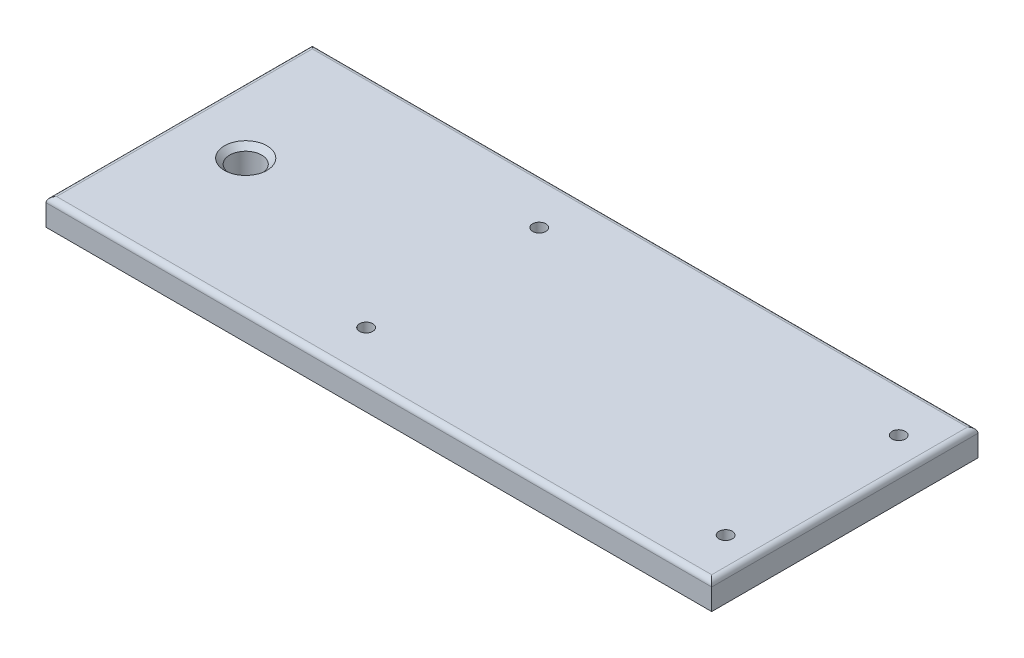
ISO-10303-21;
HEADER;
FILE_DESCRIPTION(('STEP AP214'),'2;1');
FILE_NAME('part.step','',(''),(''),'','','');
FILE_SCHEMA(('AUTOMOTIVE_DESIGN { 1 0 10303 214 1 1 1 1 }'));
ENDSEC;
DATA;
#1=APPLICATION_CONTEXT('core data for automotive mechanical design processes');
#2=APPLICATION_PROTOCOL_DEFINITION('international standard','automotive_design',2000,#1);
#3=PRODUCT_CONTEXT('',#1,'mechanical');
#4=PRODUCT('Part','Part','',(#3));
#5=PRODUCT_RELATED_PRODUCT_CATEGORY('part','',(#4));
#6=PRODUCT_DEFINITION_FORMATION('','',#4);
#7=PRODUCT_DEFINITION_CONTEXT('part definition',#1,'design');
#8=PRODUCT_DEFINITION('design','',#6,#7);
#9=PRODUCT_DEFINITION_SHAPE('','',#8);
#10=(LENGTH_UNIT() NAMED_UNIT(*) SI_UNIT(.MILLI.,.METRE.));
#11=(NAMED_UNIT(*) PLANE_ANGLE_UNIT() SI_UNIT($,.RADIAN.));
#12=(NAMED_UNIT(*) SI_UNIT($,.STERADIAN.) SOLID_ANGLE_UNIT());
#13=UNCERTAINTY_MEASURE_WITH_UNIT(LENGTH_MEASURE(1.E-05),#10,'distance_accuracy_value','');
#14=(GEOMETRIC_REPRESENTATION_CONTEXT(3) GLOBAL_UNCERTAINTY_ASSIGNED_CONTEXT((#13)) GLOBAL_UNIT_ASSIGNED_CONTEXT((#10,
#11,#12)) REPRESENTATION_CONTEXT('',''));
#15=CARTESIAN_POINT('',(0.,0.,0.));
#16=DIRECTION('',(0.,0.,1.));
#17=DIRECTION('',(1.,0.,0.));
#18=AXIS2_PLACEMENT_3D('',#15,#16,#17);
#19=CARTESIAN_POINT('',(-125.,10.,50.));
#20=DIRECTION('',(1.,0.,0.));
#21=DIRECTION('',(0.,0.,-1.));
#22=AXIS2_PLACEMENT_3D('',#19,#20,#21);
#23=PLANE('',#22);
#24=DIRECTION('',(0.,-1.,0.));
#25=VECTOR('',#24,1.);
#26=CARTESIAN_POINT('',(-125.,10.,50.));
#27=LINE('',#26,#25);
#28=CARTESIAN_POINT('',(-125.,8.,50.));
#29=VERTEX_POINT('',#28);
#30=CARTESIAN_POINT('',(-125.,0.,50.));
#31=VERTEX_POINT('',#30);
#32=EDGE_CURVE('E89',#29,#31,#27,.T.);
#33=ORIENTED_EDGE('',*,*,#32,.F.);
#34=DIRECTION('',(0.,0.,1.));
#35=VECTOR('',#34,1.);
#36=CARTESIAN_POINT('',(-125.,8.,-50.));
#37=LINE('',#36,#35);
#38=CARTESIAN_POINT('',(-125.,8.,-50.));
#39=VERTEX_POINT('',#38);
#40=EDGE_CURVE('E137',#29,#39,#37,.F.);
#41=ORIENTED_EDGE('',*,*,#40,.T.);
#42=DIRECTION('',(0.,-1.,0.));
#43=VECTOR('',#42,1.);
#44=CARTESIAN_POINT('',(-125.,10.,-50.));
#45=LINE('',#44,#43);
#46=CARTESIAN_POINT('',(-125.,0.,-50.));
#47=VERTEX_POINT('',#46);
#48=EDGE_CURVE('E111',#39,#47,#45,.T.);
#49=ORIENTED_EDGE('',*,*,#48,.T.);
#50=DIRECTION('',(0.,0.,1.));
#51=VECTOR('',#50,1.);
#52=CARTESIAN_POINT('',(-125.,0.,50.));
#53=LINE('',#52,#51);
#54=EDGE_CURVE('E107',#47,#31,#53,.T.);
#55=ORIENTED_EDGE('',*,*,#54,.T.);
#56=EDGE_LOOP('',(#33,#41,#49,#55));
#57=FACE_BOUND('',#56,.T.);
#58=ADVANCED_FACE('F35',(#57),#23,.F.);
#59=CARTESIAN_POINT('',(125.,10.,50.));
#60=DIRECTION('',(0.,0.,-1.));
#61=DIRECTION('',(-1.,0.,0.));
#62=AXIS2_PLACEMENT_3D('',#59,#60,#61);
#63=PLANE('',#62);
#64=DIRECTION('',(0.,-1.,0.));
#65=VECTOR('',#64,1.);
#66=CARTESIAN_POINT('',(125.,10.,50.));
#67=LINE('',#66,#65);
#68=CARTESIAN_POINT('',(125.,8.,50.));
#69=VERTEX_POINT('',#68);
#70=CARTESIAN_POINT('',(125.,0.,50.));
#71=VERTEX_POINT('',#70);
#72=EDGE_CURVE('E101',#69,#71,#67,.T.);
#73=ORIENTED_EDGE('',*,*,#72,.F.);
#74=DIRECTION('',(1.,0.,0.));
#75=VECTOR('',#74,1.);
#76=CARTESIAN_POINT('',(-125.,8.,50.));
#77=LINE('',#76,#75);
#78=EDGE_CURVE('E95',#69,#29,#77,.F.);
#79=ORIENTED_EDGE('',*,*,#78,.T.);
#80=ORIENTED_EDGE('',*,*,#32,.T.);
#81=DIRECTION('',(1.,0.,0.));
#82=VECTOR('',#81,1.);
#83=CARTESIAN_POINT('',(125.,0.,50.));
#84=LINE('',#83,#82);
#85=EDGE_CURVE('E92',#31,#71,#84,.T.);
#86=ORIENTED_EDGE('',*,*,#85,.T.);
#87=EDGE_LOOP('',(#73,#79,#80,#86));
#88=FACE_BOUND('',#87,.T.);
#89=ADVANCED_FACE('F91',(#88),#63,.F.);
#90=CARTESIAN_POINT('',(125.,10.,50.));
#91=DIRECTION('',(-1.,0.,0.));
#92=DIRECTION('',(0.,0.,1.));
#93=AXIS2_PLACEMENT_3D('',#90,#91,#92);
#94=PLANE('',#93);
#95=DIRECTION('',(0.,-1.,0.));
#96=VECTOR('',#95,1.);
#97=CARTESIAN_POINT('',(125.,10.,-50.));
#98=LINE('',#97,#96);
#99=CARTESIAN_POINT('',(125.,8.,-50.));
#100=VERTEX_POINT('',#99);
#101=CARTESIAN_POINT('',(125.,0.,-50.));
#102=VERTEX_POINT('',#101);
#103=EDGE_CURVE('E126',#100,#102,#98,.T.);
#104=ORIENTED_EDGE('',*,*,#103,.F.);
#105=DIRECTION('',(0.,0.,-1.));
#106=VECTOR('',#105,1.);
#107=CARTESIAN_POINT('',(125.,8.,50.));
#108=LINE('',#107,#106);
#109=EDGE_CURVE('E50',#100,#69,#108,.F.);
#110=ORIENTED_EDGE('',*,*,#109,.T.);
#111=ORIENTED_EDGE('',*,*,#72,.T.);
#112=DIRECTION('',(0.,0.,-1.));
#113=VECTOR('',#112,1.);
#114=CARTESIAN_POINT('',(125.,0.,50.));
#115=LINE('',#114,#113);
#116=EDGE_CURVE('E109',#71,#102,#115,.T.);
#117=ORIENTED_EDGE('',*,*,#116,.T.);
#118=EDGE_LOOP('',(#104,#110,#111,#117));
#119=FACE_BOUND('',#118,.T.);
#120=ADVANCED_FACE('F172',(#119),#94,.F.);
#121=CARTESIAN_POINT('',(125.,10.,-50.));
#122=DIRECTION('',(0.,0.,1.));
#123=DIRECTION('',(1.,0.,0.));
#124=AXIS2_PLACEMENT_3D('',#121,#122,#123);
#125=PLANE('',#124);
#126=ORIENTED_EDGE('',*,*,#48,.F.);
#127=DIRECTION('',(-1.,0.,0.));
#128=VECTOR('',#127,1.);
#129=CARTESIAN_POINT('',(125.,8.,-50.));
#130=LINE('',#129,#128);
#131=EDGE_CURVE('E58',#39,#100,#130,.F.);
#132=ORIENTED_EDGE('',*,*,#131,.T.);
#133=ORIENTED_EDGE('',*,*,#103,.T.);
#134=DIRECTION('',(-1.,0.,0.));
#135=VECTOR('',#134,1.);
#136=CARTESIAN_POINT('',(125.,0.,-50.));
#137=LINE('',#136,#135);
#138=EDGE_CURVE('E123',#102,#47,#137,.T.);
#139=ORIENTED_EDGE('',*,*,#138,.T.);
#140=EDGE_LOOP('',(#126,#132,#133,#139));
#141=FACE_BOUND('',#140,.T.);
#142=ADVANCED_FACE('F203',(#141),#125,.F.);
#143=CARTESIAN_POINT('',(0.,10.,0.));
#144=DIRECTION('',(0.,1.,0.));
#145=DIRECTION('',(0.,0.,1.));
#146=AXIS2_PLACEMENT_3D('',#143,#144,#145);
#147=PLANE('',#146);
#148=CARTESIAN_POINT('',(112.723846373884,10.,32.5));
#149=DIRECTION('',(0.,1.,0.));
#150=DIRECTION('',(0.,0.,1.));
#151=AXIS2_PLACEMENT_3D('',#148,#149,#150);
#152=CIRCLE('',#151,2.5);
#153=CARTESIAN_POINT('',(112.723846373884,10.,35.));
#154=VERTEX_POINT('',#153);
#155=EDGE_CURVE('E241',#154,#154,#152,.T.);
#156=ORIENTED_EDGE('',*,*,#155,.F.);
#157=EDGE_LOOP('',(#156));
#158=FACE_BOUND('',#157,.T.);
#159=CARTESIAN_POINT('',(-22.2761536261155,10.,-32.5000000000001));
#160=DIRECTION('',(0.,1.,0.));
#161=DIRECTION('',(0.,0.,1.));
#162=AXIS2_PLACEMENT_3D('',#159,#160,#161);
#163=CIRCLE('',#162,2.49999999999999);
#164=CARTESIAN_POINT('',(-22.2761536261155,10.,-30.0000000000001));
#165=VERTEX_POINT('',#164);
#166=EDGE_CURVE('E234',#165,#165,#163,.T.);
#167=ORIENTED_EDGE('',*,*,#166,.F.);
#168=EDGE_LOOP('',(#167));
#169=FACE_BOUND('',#168,.T.);
#170=CARTESIAN_POINT('',(-22.2761536261155,10.,32.4999999999999));
#171=DIRECTION('',(0.,1.,0.));
#172=DIRECTION('',(0.,0.,1.));
#173=AXIS2_PLACEMENT_3D('',#170,#171,#172);
#174=CIRCLE('',#173,2.49999999999999);
#175=CARTESIAN_POINT('',(-22.2761536261155,10.,34.9999999999999));
#176=VERTEX_POINT('',#175);
#177=EDGE_CURVE('E231',#176,#176,#174,.T.);
#178=ORIENTED_EDGE('',*,*,#177,.F.);
#179=EDGE_LOOP('',(#178));
#180=FACE_BOUND('',#179,.T.);
#181=CARTESIAN_POINT('',(112.723846373884,10.,-32.5000000000001));
#182=DIRECTION('',(0.,1.,0.));
#183=DIRECTION('',(0.,0.,1.));
#184=AXIS2_PLACEMENT_3D('',#181,#182,#183);
#185=CIRCLE('',#184,2.5);
#186=CARTESIAN_POINT('',(112.723846373884,10.,-30.0000000000001));
#187=VERTEX_POINT('',#186);
#188=EDGE_CURVE('E240',#187,#187,#185,.T.);
#189=ORIENTED_EDGE('',*,*,#188,.F.);
#190=EDGE_LOOP('',(#189));
#191=FACE_BOUND('',#190,.T.);
#192=CARTESIAN_POINT('',(-100.,10.,0.));
#193=DIRECTION('',(0.,1.,0.));
#194=DIRECTION('',(0.,0.,1.));
#195=AXIS2_PLACEMENT_3D('',#192,#193,#194);
#196=CIRCLE('',#195,8.00000000000001);
#197=CARTESIAN_POINT('',(-100.,10.,8.00000000000001));
#198=VERTEX_POINT('',#197);
#199=EDGE_CURVE('E11',#198,#198,#196,.F.);
#200=ORIENTED_EDGE('',*,*,#199,.T.);
#201=EDGE_LOOP('',(#200));
#202=FACE_BOUND('',#201,.T.);
#203=DIRECTION('',(-1.,0.,0.));
#204=VECTOR('',#203,1.);
#205=CARTESIAN_POINT('',(-125.,10.,-48.));
#206=LINE('',#205,#204);
#207=CARTESIAN_POINT('',(123.,10.,-48.));
#208=VERTEX_POINT('',#207);
#209=CARTESIAN_POINT('',(-123.,10.,-48.));
#210=VERTEX_POINT('',#209);
#211=EDGE_CURVE('E132',#208,#210,#206,.T.);
#212=ORIENTED_EDGE('',*,*,#211,.T.);
#213=DIRECTION('',(0.,0.,1.));
#214=VECTOR('',#213,1.);
#215=CARTESIAN_POINT('',(-123.,10.,50.));
#216=LINE('',#215,#214);
#217=CARTESIAN_POINT('',(-123.,10.,48.));
#218=VERTEX_POINT('',#217);
#219=EDGE_CURVE('E134',#210,#218,#216,.T.);
#220=ORIENTED_EDGE('',*,*,#219,.T.);
#221=DIRECTION('',(1.,0.,0.));
#222=VECTOR('',#221,1.);
#223=CARTESIAN_POINT('',(125.,10.,48.));
#224=LINE('',#223,#222);
#225=CARTESIAN_POINT('',(123.,10.,48.));
#226=VERTEX_POINT('',#225);
#227=EDGE_CURVE('E100',#218,#226,#224,.T.);
#228=ORIENTED_EDGE('',*,*,#227,.T.);
#229=DIRECTION('',(0.,0.,-1.));
#230=VECTOR('',#229,1.);
#231=CARTESIAN_POINT('',(123.,10.,-50.));
#232=LINE('',#231,#230);
#233=EDGE_CURVE('E130',#226,#208,#232,.T.);
#234=ORIENTED_EDGE('',*,*,#233,.T.);
#235=EDGE_LOOP('',(#212,#220,#228,#234));
#236=FACE_BOUND('',#235,.T.);
#237=ADVANCED_FACE('F193',(#158,#169,#180,#191,#202,#236),#147,.T.);
#238=CARTESIAN_POINT('',(0.,0.,0.));
#239=DIRECTION('',(0.,1.,0.));
#240=DIRECTION('',(0.,0.,1.));
#241=AXIS2_PLACEMENT_3D('',#238,#239,#240);
#242=PLANE('',#241);
#243=CARTESIAN_POINT('',(112.723846373884,0.,32.5));
#244=DIRECTION('',(0.,1.,0.));
#245=DIRECTION('',(0.,0.,1.));
#246=AXIS2_PLACEMENT_3D('',#243,#244,#245);
#247=CIRCLE('',#246,2.5);
#248=CARTESIAN_POINT('',(112.723846373884,0.,35.));
#249=VERTEX_POINT('',#248);
#250=EDGE_CURVE('E237',#249,#249,#247,.T.);
#251=ORIENTED_EDGE('',*,*,#250,.T.);
#252=EDGE_LOOP('',(#251));
#253=FACE_BOUND('',#252,.T.);
#254=CARTESIAN_POINT('',(-22.2761536261155,0.,-32.5000000000001));
#255=DIRECTION('',(0.,1.,0.));
#256=DIRECTION('',(0.,0.,1.));
#257=AXIS2_PLACEMENT_3D('',#254,#255,#256);
#258=CIRCLE('',#257,2.49999999999999);
#259=CARTESIAN_POINT('',(-22.2761536261155,0.,-30.0000000000001));
#260=VERTEX_POINT('',#259);
#261=EDGE_CURVE('E244',#260,#260,#258,.T.);
#262=ORIENTED_EDGE('',*,*,#261,.T.);
#263=EDGE_LOOP('',(#262));
#264=FACE_BOUND('',#263,.T.);
#265=CARTESIAN_POINT('',(-22.2761536261155,0.,32.4999999999999));
#266=DIRECTION('',(0.,1.,0.));
#267=DIRECTION('',(0.,0.,1.));
#268=AXIS2_PLACEMENT_3D('',#265,#266,#267);
#269=CIRCLE('',#268,2.49999999999999);
#270=CARTESIAN_POINT('',(-22.2761536261155,0.,34.9999999999999));
#271=VERTEX_POINT('',#270);
#272=EDGE_CURVE('E228',#271,#271,#269,.T.);
#273=ORIENTED_EDGE('',*,*,#272,.T.);
#274=EDGE_LOOP('',(#273));
#275=FACE_BOUND('',#274,.T.);
#276=CARTESIAN_POINT('',(112.723846373884,0.,-32.5000000000001));
#277=DIRECTION('',(0.,1.,0.));
#278=DIRECTION('',(0.,0.,1.));
#279=AXIS2_PLACEMENT_3D('',#276,#277,#278);
#280=CIRCLE('',#279,2.5);
#281=CARTESIAN_POINT('',(112.723846373884,0.,-30.0000000000001));
#282=VERTEX_POINT('',#281);
#283=EDGE_CURVE('E249',#282,#282,#280,.T.);
#284=ORIENTED_EDGE('',*,*,#283,.T.);
#285=EDGE_LOOP('',(#284));
#286=FACE_BOUND('',#285,.T.);
#287=CARTESIAN_POINT('',(-100.,0.,0.));
#288=DIRECTION('',(0.,1.,0.));
#289=DIRECTION('',(0.,0.,1.));
#290=AXIS2_PLACEMENT_3D('',#287,#288,#289);
#291=CIRCLE('',#290,6.);
#292=CARTESIAN_POINT('',(-100.,0.,6.));
#293=VERTEX_POINT('',#292);
#294=EDGE_CURVE('E119',#293,#293,#291,.T.);
#295=ORIENTED_EDGE('',*,*,#294,.T.);
#296=EDGE_LOOP('',(#295));
#297=FACE_BOUND('',#296,.T.);
#298=ORIENTED_EDGE('',*,*,#54,.F.);
#299=ORIENTED_EDGE('',*,*,#138,.F.);
#300=ORIENTED_EDGE('',*,*,#116,.F.);
#301=ORIENTED_EDGE('',*,*,#85,.F.);
#302=EDGE_LOOP('',(#298,#299,#300,#301));
#303=FACE_BOUND('',#302,.T.);
#304=ADVANCED_FACE('F105',(#253,#264,#275,#286,#297,#303),#242,.F.);
#305=CARTESIAN_POINT('',(123.,8.,0.));
#306=DIRECTION('',(0.,0.,1.));
#307=DIRECTION('',(1.,0.,0.));
#308=AXIS2_PLACEMENT_3D('',#305,#306,#307);
#309=CYLINDRICAL_SURFACE('',#308,2.);
#310=CARTESIAN_POINT('',(123.,8.,48.));
#311=DIRECTION('',(-0.707106781186547,0.,0.707106781186547));
#312=DIRECTION('',(-0.707106781186547,0.,-0.707106781186547));
#313=AXIS2_PLACEMENT_3D('',#310,#311,#312);
#314=ELLIPSE('',#313,2.82842712474619,2.);
#315=EDGE_CURVE('E116',#69,#226,#314,.T.);
#316=ORIENTED_EDGE('',*,*,#315,.F.);
#317=ORIENTED_EDGE('',*,*,#109,.F.);
#318=CARTESIAN_POINT('',(123.,8.,-48.));
#319=DIRECTION('',(0.707106781186547,0.,0.707106781186547));
#320=DIRECTION('',(-0.707106781186547,0.,0.707106781186547));
#321=AXIS2_PLACEMENT_3D('',#318,#319,#320);
#322=ELLIPSE('',#321,2.82842712474619,2.);
#323=EDGE_CURVE('E113',#208,#100,#322,.F.);
#324=ORIENTED_EDGE('',*,*,#323,.F.);
#325=ORIENTED_EDGE('',*,*,#233,.F.);
#326=EDGE_LOOP('',(#316,#317,#324,#325));
#327=FACE_BOUND('',#326,.T.);
#328=ADVANCED_FACE('F185',(#327),#309,.T.);
#329=CARTESIAN_POINT('',(0.,8.,-48.));
#330=DIRECTION('',(1.,0.,0.));
#331=DIRECTION('',(0.,0.,-1.));
#332=AXIS2_PLACEMENT_3D('',#329,#330,#331);
#333=CYLINDRICAL_SURFACE('',#332,2.);
#334=ORIENTED_EDGE('',*,*,#323,.T.);
#335=ORIENTED_EDGE('',*,*,#131,.F.);
#336=CARTESIAN_POINT('',(-123.,8.,-48.));
#337=DIRECTION('',(0.707106781186547,0.,-0.707106781186547));
#338=DIRECTION('',(0.707106781186547,0.,0.707106781186547));
#339=AXIS2_PLACEMENT_3D('',#336,#337,#338);
#340=ELLIPSE('',#339,2.82842712474619,2.);
#341=EDGE_CURVE('E144',#210,#39,#340,.F.);
#342=ORIENTED_EDGE('',*,*,#341,.F.);
#343=ORIENTED_EDGE('',*,*,#211,.F.);
#344=EDGE_LOOP('',(#334,#335,#342,#343));
#345=FACE_BOUND('',#344,.T.);
#346=ADVANCED_FACE('F182',(#345),#333,.T.);
#347=CARTESIAN_POINT('',(0.,8.,48.));
#348=DIRECTION('',(-1.,0.,0.));
#349=DIRECTION('',(0.,0.,1.));
#350=AXIS2_PLACEMENT_3D('',#347,#348,#349);
#351=CYLINDRICAL_SURFACE('',#350,2.);
#352=ORIENTED_EDGE('',*,*,#315,.T.);
#353=ORIENTED_EDGE('',*,*,#227,.F.);
#354=CARTESIAN_POINT('',(-123.,8.,48.));
#355=DIRECTION('',(-0.707106781186547,0.,-0.707106781186547));
#356=DIRECTION('',(-0.707106781186547,0.,0.707106781186547));
#357=AXIS2_PLACEMENT_3D('',#354,#355,#356);
#358=ELLIPSE('',#357,2.82842712474619,2.);
#359=EDGE_CURVE('E142',#29,#218,#358,.T.);
#360=ORIENTED_EDGE('',*,*,#359,.F.);
#361=ORIENTED_EDGE('',*,*,#78,.F.);
#362=EDGE_LOOP('',(#352,#353,#360,#361));
#363=FACE_BOUND('',#362,.T.);
#364=ADVANCED_FACE('F178',(#363),#351,.T.);
#365=CARTESIAN_POINT('',(-123.,8.,0.));
#366=DIRECTION('',(0.,0.,-1.));
#367=DIRECTION('',(-1.,0.,0.));
#368=AXIS2_PLACEMENT_3D('',#365,#366,#367);
#369=CYLINDRICAL_SURFACE('',#368,2.);
#370=ORIENTED_EDGE('',*,*,#341,.T.);
#371=ORIENTED_EDGE('',*,*,#40,.F.);
#372=ORIENTED_EDGE('',*,*,#359,.T.);
#373=ORIENTED_EDGE('',*,*,#219,.F.);
#374=EDGE_LOOP('',(#370,#371,#372,#373));
#375=FACE_BOUND('',#374,.T.);
#376=ADVANCED_FACE('F164',(#375),#369,.T.);
#377=CARTESIAN_POINT('',(-100.,0.,0.));
#378=DIRECTION('',(0.,1.,0.));
#379=DIRECTION('',(0.,0.,1.));
#380=AXIS2_PLACEMENT_3D('',#377,#378,#379);
#381=CYLINDRICAL_SURFACE('',#380,6.);
#382=CARTESIAN_POINT('',(-100.,7.99999999999997,0.));
#383=DIRECTION('',(0.,1.,0.));
#384=DIRECTION('',(0.,0.,1.));
#385=AXIS2_PLACEMENT_3D('',#382,#383,#384);
#386=CIRCLE('',#385,6.);
#387=CARTESIAN_POINT('',(-100.,7.99999999999997,6.));
#388=VERTEX_POINT('',#387);
#389=EDGE_CURVE('E43',#388,#388,#386,.T.);
#390=ORIENTED_EDGE('',*,*,#389,.T.);
#391=EDGE_LOOP('',(#390));
#392=FACE_BOUND('',#391,.T.);
#393=ORIENTED_EDGE('',*,*,#294,.F.);
#394=EDGE_LOOP('',(#393));
#395=FACE_BOUND('',#394,.T.);
#396=ADVANCED_FACE('F150',(#392,#395),#381,.F.);
#397=CARTESIAN_POINT('',(-100.,7.99999999999997,0.));
#398=DIRECTION('',(0.,1.,0.));
#399=DIRECTION('',(0.,0.,1.));
#400=AXIS2_PLACEMENT_3D('',#397,#398,#399);
#401=CONICAL_SURFACE('',#400,6.,0.785398163397443);
#402=ORIENTED_EDGE('',*,*,#199,.F.);
#403=EDGE_LOOP('',(#402));
#404=FACE_BOUND('',#403,.T.);
#405=ORIENTED_EDGE('',*,*,#389,.F.);
#406=EDGE_LOOP('',(#405));
#407=FACE_BOUND('',#406,.T.);
#408=ADVANCED_FACE('F37',(#404,#407),#401,.F.);
#409=CARTESIAN_POINT('',(112.723846373884,0.,-32.5000000000001));
#410=DIRECTION('',(0.,1.,0.));
#411=DIRECTION('',(0.,0.,1.));
#412=AXIS2_PLACEMENT_3D('',#409,#410,#411);
#413=CYLINDRICAL_SURFACE('',#412,2.5);
#414=ORIENTED_EDGE('',*,*,#283,.F.);
#415=EDGE_LOOP('',(#414));
#416=FACE_BOUND('',#415,.T.);
#417=ORIENTED_EDGE('',*,*,#188,.T.);
#418=EDGE_LOOP('',(#417));
#419=FACE_BOUND('',#418,.T.);
#420=ADVANCED_FACE('F154',(#416,#419),#413,.F.);
#421=CARTESIAN_POINT('',(-22.2761536261155,0.,32.4999999999999));
#422=DIRECTION('',(0.,1.,0.));
#423=DIRECTION('',(0.,0.,1.));
#424=AXIS2_PLACEMENT_3D('',#421,#422,#423);
#425=CYLINDRICAL_SURFACE('',#424,2.49999999999999);
#426=ORIENTED_EDGE('',*,*,#272,.F.);
#427=EDGE_LOOP('',(#426));
#428=FACE_BOUND('',#427,.T.);
#429=ORIENTED_EDGE('',*,*,#177,.T.);
#430=EDGE_LOOP('',(#429));
#431=FACE_BOUND('',#430,.T.);
#432=ADVANCED_FACE('F160',(#428,#431),#425,.F.);
#433=CARTESIAN_POINT('',(-22.2761536261155,0.,-32.5000000000001));
#434=DIRECTION('',(0.,1.,0.));
#435=DIRECTION('',(0.,0.,1.));
#436=AXIS2_PLACEMENT_3D('',#433,#434,#435);
#437=CYLINDRICAL_SURFACE('',#436,2.49999999999999);
#438=ORIENTED_EDGE('',*,*,#261,.F.);
#439=EDGE_LOOP('',(#438));
#440=FACE_BOUND('',#439,.T.);
#441=ORIENTED_EDGE('',*,*,#166,.T.);
#442=EDGE_LOOP('',(#441));
#443=FACE_BOUND('',#442,.T.);
#444=ADVANCED_FACE('F213',(#440,#443),#437,.F.);
#445=CARTESIAN_POINT('',(112.723846373884,0.,32.5));
#446=DIRECTION('',(0.,1.,0.));
#447=DIRECTION('',(0.,0.,1.));
#448=AXIS2_PLACEMENT_3D('',#445,#446,#447);
#449=CYLINDRICAL_SURFACE('',#448,2.5);
#450=ORIENTED_EDGE('',*,*,#250,.F.);
#451=EDGE_LOOP('',(#450));
#452=FACE_BOUND('',#451,.T.);
#453=ORIENTED_EDGE('',*,*,#155,.T.);
#454=EDGE_LOOP('',(#453));
#455=FACE_BOUND('',#454,.T.);
#456=ADVANCED_FACE('F216',(#452,#455),#449,.F.);
#457=CLOSED_SHELL('',(#58,#89,#120,#142,#237,#304,#328,#346,#364,#376,#396,#408,#420,#432,#444,#456));
#458=MANIFOLD_SOLID_BREP('B2',#457);
#459=ADVANCED_BREP_SHAPE_REPRESENTATION('',(#18,#458),#14);
#460=SHAPE_DEFINITION_REPRESENTATION(#9,#459);
ENDSEC;
END-ISO-10303-21;
